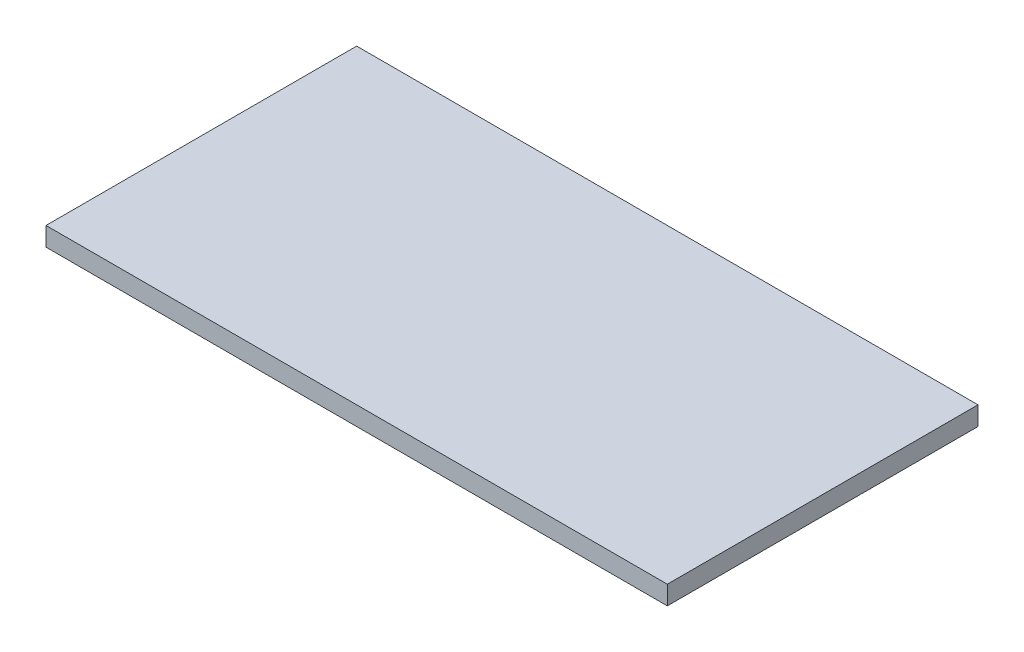
ISO-10303-21;
HEADER;
FILE_DESCRIPTION(('STEP AP214'),'2;1');
FILE_NAME('part.step','',(''),(''),'','','');
FILE_SCHEMA(('AUTOMOTIVE_DESIGN { 1 0 10303 214 1 1 1 1 }'));
ENDSEC;
DATA;
#1=APPLICATION_CONTEXT('core data for automotive mechanical design processes');
#2=APPLICATION_PROTOCOL_DEFINITION('international standard','automotive_design',2000,#1);
#3=PRODUCT_CONTEXT('',#1,'mechanical');
#4=PRODUCT('Part','Part','',(#3));
#5=PRODUCT_RELATED_PRODUCT_CATEGORY('part','',(#4));
#6=PRODUCT_DEFINITION_FORMATION('','',#4);
#7=PRODUCT_DEFINITION_CONTEXT('part definition',#1,'design');
#8=PRODUCT_DEFINITION('design','',#6,#7);
#9=PRODUCT_DEFINITION_SHAPE('','',#8);
#10=(LENGTH_UNIT() NAMED_UNIT(*) SI_UNIT(.MILLI.,.METRE.));
#11=(NAMED_UNIT(*) PLANE_ANGLE_UNIT() SI_UNIT($,.RADIAN.));
#12=(NAMED_UNIT(*) SI_UNIT($,.STERADIAN.) SOLID_ANGLE_UNIT());
#13=UNCERTAINTY_MEASURE_WITH_UNIT(LENGTH_MEASURE(1.E-05),#10,'distance_accuracy_value','');
#14=(GEOMETRIC_REPRESENTATION_CONTEXT(3) GLOBAL_UNCERTAINTY_ASSIGNED_CONTEXT((#13)) GLOBAL_UNIT_ASSIGNED_CONTEXT((#10,
#11,#12)) REPRESENTATION_CONTEXT('',''));
#15=CARTESIAN_POINT('',(0.,0.,0.));
#16=DIRECTION('',(0.,0.,1.));
#17=DIRECTION('',(1.,0.,0.));
#18=AXIS2_PLACEMENT_3D('',#15,#16,#17);
#19=CARTESIAN_POINT('',(10.,0.,0.));
#20=DIRECTION('',(-1.,0.,0.));
#21=DIRECTION('',(0.,0.,1.));
#22=AXIS2_PLACEMENT_3D('',#19,#20,#21);
#23=CYLINDRICAL_SURFACE('',#22,2.3);
#24=CARTESIAN_POINT('',(3.56144422615147,0.,0.));
#25=DIRECTION('',(-1.,0.,0.));
#26=DIRECTION('',(0.,0.,1.));
#27=AXIS2_PLACEMENT_3D('',#24,#25,#26);
#28=CIRCLE('',#27,2.3);
#29=CARTESIAN_POINT('',(3.56144422615147,0.,2.3));
#30=VERTEX_POINT('',#29);
#31=EDGE_CURVE('E228',#30,#30,#28,.T.);
#32=ORIENTED_EDGE('',*,*,#31,.T.);
#33=EDGE_LOOP('',(#32));
#34=FACE_BOUND('',#33,.T.);
#35=CARTESIAN_POINT('',(6.44,0.,0.));
#36=DIRECTION('',(1.,0.,0.));
#37=DIRECTION('',(0.,0.,-1.));
#38=AXIS2_PLACEMENT_3D('',#35,#36,#37);
#39=CIRCLE('',#38,2.3);
#40=CARTESIAN_POINT('',(6.44,0.,-2.3));
#41=VERTEX_POINT('',#40);
#42=EDGE_CURVE('E174',#41,#41,#39,.T.);
#43=ORIENTED_EDGE('',*,*,#42,.T.);
#44=EDGE_LOOP('',(#43));
#45=FACE_BOUND('',#44,.T.);
#46=ADVANCED_FACE('F33',(#34,#45),#23,.F.);
#47=CARTESIAN_POINT('',(0.,-4.,-5.));
#48=DIRECTION('',(-1.,0.,0.));
#49=DIRECTION('',(0.,0.,1.));
#50=AXIS2_PLACEMENT_3D('',#47,#48,#49);
#51=PLANE('',#50);
#52=DIRECTION('',(0.,1.,0.));
#53=VECTOR('',#52,1.);
#54=CARTESIAN_POINT('',(0.,-4.,-5.));
#55=LINE('',#54,#53);
#56=CARTESIAN_POINT('',(0.,-1.,-5.));
#57=VERTEX_POINT('',#56);
#58=CARTESIAN_POINT('',(0.,0.,-5.));
#59=VERTEX_POINT('',#58);
#60=EDGE_CURVE('E202',#57,#59,#55,.T.);
#61=ORIENTED_EDGE('',*,*,#60,.F.);
#62=CARTESIAN_POINT('',(0.,-1.,-2.));
#63=DIRECTION('',(-1.,0.,0.));
#64=DIRECTION('',(0.,0.,1.));
#65=AXIS2_PLACEMENT_3D('',#62,#63,#64);
#66=CIRCLE('',#65,3.);
#67=CARTESIAN_POINT('',(0.,-4.,-2.));
#68=VERTEX_POINT('',#67);
#69=EDGE_CURVE('E42',#57,#68,#66,.T.);
#70=ORIENTED_EDGE('',*,*,#69,.T.);
#71=DIRECTION('',(0.,0.,1.));
#72=VECTOR('',#71,1.);
#73=CARTESIAN_POINT('',(0.,-4.,-5.));
#74=LINE('',#73,#72);
#75=CARTESIAN_POINT('',(0.,-4.,2.));
#76=VERTEX_POINT('',#75);
#77=EDGE_CURVE('E197',#68,#76,#74,.T.);
#78=ORIENTED_EDGE('',*,*,#77,.T.);
#79=CARTESIAN_POINT('',(0.,-1.,2.));
#80=DIRECTION('',(-1.,0.,0.));
#81=DIRECTION('',(0.,0.,1.));
#82=AXIS2_PLACEMENT_3D('',#79,#80,#81);
#83=CIRCLE('',#82,3.);
#84=CARTESIAN_POINT('',(0.,-1.,5.));
#85=VERTEX_POINT('',#84);
#86=EDGE_CURVE('E50',#76,#85,#83,.T.);
#87=ORIENTED_EDGE('',*,*,#86,.T.);
#88=DIRECTION('',(0.,1.,0.));
#89=VECTOR('',#88,1.);
#90=CARTESIAN_POINT('',(0.,-4.,5.));
#91=LINE('',#90,#89);
#92=CARTESIAN_POINT('',(0.,0.,5.));
#93=VERTEX_POINT('',#92);
#94=EDGE_CURVE('E201',#85,#93,#91,.T.);
#95=ORIENTED_EDGE('',*,*,#94,.T.);
#96=CARTESIAN_POINT('',(0.,0.,8.));
#97=DIRECTION('',(-1.,0.,0.));
#98=DIRECTION('',(0.,0.,1.));
#99=AXIS2_PLACEMENT_3D('',#96,#97,#98);
#100=CIRCLE('',#99,3.);
#101=CARTESIAN_POINT('',(0.,3.,8.));
#102=VERTEX_POINT('',#101);
#103=EDGE_CURVE('E481',#93,#102,#100,.F.);
#104=ORIENTED_EDGE('',*,*,#103,.T.);
#105=DIRECTION('',(0.,0.,1.));
#106=VECTOR('',#105,1.);
#107=CARTESIAN_POINT('',(0.,3.,-16.5));
#108=LINE('',#107,#106);
#109=CARTESIAN_POINT('',(0.,3.,16.5));
#110=VERTEX_POINT('',#109);
#111=EDGE_CURVE('E172',#102,#110,#108,.T.);
#112=ORIENTED_EDGE('',*,*,#111,.T.);
#113=DIRECTION('',(0.,-1.,0.));
#114=VECTOR('',#113,1.);
#115=CARTESIAN_POINT('',(0.,5.,16.5));
#116=LINE('',#115,#114);
#117=CARTESIAN_POINT('',(0.,5.,16.5));
#118=VERTEX_POINT('',#117);
#119=EDGE_CURVE('E153',#118,#110,#116,.T.);
#120=ORIENTED_EDGE('',*,*,#119,.F.);
#121=DIRECTION('',(0.,0.,1.));
#122=VECTOR('',#121,1.);
#123=CARTESIAN_POINT('',(0.,5.,-16.5));
#124=LINE('',#123,#122);
#125=CARTESIAN_POINT('',(0.,5.,-16.5));
#126=VERTEX_POINT('',#125);
#127=EDGE_CURVE('E159',#126,#118,#124,.T.);
#128=ORIENTED_EDGE('',*,*,#127,.F.);
#129=DIRECTION('',(0.,-1.,0.));
#130=VECTOR('',#129,1.);
#131=CARTESIAN_POINT('',(0.,5.,-16.5));
#132=LINE('',#131,#130);
#133=CARTESIAN_POINT('',(0.,3.,-16.5));
#134=VERTEX_POINT('',#133);
#135=EDGE_CURVE('E535',#126,#134,#132,.T.);
#136=ORIENTED_EDGE('',*,*,#135,.T.);
#137=CARTESIAN_POINT('',(0.,3.,-8.));
#138=VERTEX_POINT('',#137);
#139=EDGE_CURVE('E524',#134,#138,#108,.T.);
#140=ORIENTED_EDGE('',*,*,#139,.T.);
#141=CARTESIAN_POINT('',(0.,0.,-8.));
#142=DIRECTION('',(-1.,0.,0.));
#143=DIRECTION('',(0.,0.,1.));
#144=AXIS2_PLACEMENT_3D('',#141,#142,#143);
#145=CIRCLE('',#144,3.);
#146=EDGE_CURVE('E485',#138,#59,#145,.F.);
#147=ORIENTED_EDGE('',*,*,#146,.T.);
#148=EDGE_LOOP('',(#61,#70,#78,#87,#95,#104,#112,#120,#128,#136,#140,#147));
#149=FACE_BOUND('',#148,.T.);
#150=CARTESIAN_POINT('',(0.,3.,-0.388104367406501));
#151=VERTEX_POINT('',#150);
#152=CARTESIAN_POINT('',(0.,3.,0.3881043674065));
#153=VERTEX_POINT('',#152);
#154=EDGE_CURVE('E523',#151,#153,#108,.T.);
#155=ORIENTED_EDGE('',*,*,#154,.T.);
#156=CARTESIAN_POINT('',(0.,0.,0.));
#157=DIRECTION('',(1.,0.,0.));
#158=DIRECTION('',(0.,0.,-1.));
#159=AXIS2_PLACEMENT_3D('',#156,#157,#158);
#160=CIRCLE('',#159,3.025);
#161=EDGE_CURVE('E193',#153,#151,#160,.T.);
#162=ORIENTED_EDGE('',*,*,#161,.T.);
#163=EDGE_LOOP('',(#155,#162));
#164=FACE_BOUND('',#163,.T.);
#165=ADVANCED_FACE('F169',(#149,#164),#51,.T.);
#166=CARTESIAN_POINT('',(0.,-4.,-5.));
#167=DIRECTION('',(0.,0.,-1.));
#168=DIRECTION('',(-1.,0.,0.));
#169=AXIS2_PLACEMENT_3D('',#166,#167,#168);
#170=PLANE('',#169);
#171=DIRECTION('',(0.,1.,0.));
#172=VECTOR('',#171,1.);
#173=CARTESIAN_POINT('',(15.,-4.,-5.));
#174=LINE('',#173,#172);
#175=CARTESIAN_POINT('',(15.,-1.,-5.));
#176=VERTEX_POINT('',#175);
#177=CARTESIAN_POINT('',(15.,0.,-5.));
#178=VERTEX_POINT('',#177);
#179=EDGE_CURVE('E205',#176,#178,#174,.T.);
#180=ORIENTED_EDGE('',*,*,#179,.F.);
#181=DIRECTION('',(-1.,0.,0.));
#182=VECTOR('',#181,1.);
#183=CARTESIAN_POINT('',(0.,-1.,-5.));
#184=LINE('',#183,#182);
#185=EDGE_CURVE('E58',#176,#57,#184,.T.);
#186=ORIENTED_EDGE('',*,*,#185,.T.);
#187=ORIENTED_EDGE('',*,*,#60,.T.);
#188=DIRECTION('',(-1.,0.,0.));
#189=VECTOR('',#188,1.);
#190=CARTESIAN_POINT('',(0.,0.,-5.));
#191=LINE('',#190,#189);
#192=EDGE_CURVE('E469',#59,#178,#191,.F.);
#193=ORIENTED_EDGE('',*,*,#192,.T.);
#194=EDGE_LOOP('',(#180,#186,#187,#193));
#195=FACE_BOUND('',#194,.T.);
#196=ADVANCED_FACE('F271',(#195),#170,.T.);
#197=CARTESIAN_POINT('',(15.,-4.,-5.));
#198=DIRECTION('',(1.,0.,0.));
#199=DIRECTION('',(0.,0.,-1.));
#200=AXIS2_PLACEMENT_3D('',#197,#198,#199);
#201=PLANE('',#200);
#202=DIRECTION('',(0.,1.,0.));
#203=VECTOR('',#202,1.);
#204=CARTESIAN_POINT('',(15.,-4.,4.99999999999999));
#205=LINE('',#204,#203);
#206=CARTESIAN_POINT('',(15.,-1.,4.99999999999999));
#207=VERTEX_POINT('',#206);
#208=CARTESIAN_POINT('',(15.,0.,4.99999999999999));
#209=VERTEX_POINT('',#208);
#210=EDGE_CURVE('E207',#207,#209,#205,.T.);
#211=ORIENTED_EDGE('',*,*,#210,.F.);
#212=DIRECTION('',(0.,0.,-1.));
#213=VECTOR('',#212,1.);
#214=CARTESIAN_POINT('',(15.,-1.,-5.));
#215=LINE('',#214,#213);
#216=EDGE_CURVE('E477',#207,#176,#215,.T.);
#217=ORIENTED_EDGE('',*,*,#216,.T.);
#218=ORIENTED_EDGE('',*,*,#179,.T.);
#219=DIRECTION('',(0.,0.,-1.));
#220=VECTOR('',#219,1.);
#221=CARTESIAN_POINT('',(15.,0.,-5.));
#222=LINE('',#221,#220);
#223=EDGE_CURVE('E474',#178,#209,#222,.F.);
#224=ORIENTED_EDGE('',*,*,#223,.T.);
#225=EDGE_LOOP('',(#211,#217,#218,#224));
#226=FACE_BOUND('',#225,.T.);
#227=ADVANCED_FACE('F380',(#226),#201,.T.);
#228=CARTESIAN_POINT('',(0.,-4.,5.));
#229=DIRECTION('',(0.,0.,1.));
#230=DIRECTION('',(1.,0.,0.));
#231=AXIS2_PLACEMENT_3D('',#228,#229,#230);
#232=PLANE('',#231);
#233=ORIENTED_EDGE('',*,*,#94,.F.);
#234=DIRECTION('',(1.,0.,0.));
#235=VECTOR('',#234,1.);
#236=CARTESIAN_POINT('',(15.,-1.,4.99999999999999));
#237=LINE('',#236,#235);
#238=EDGE_CURVE('E11',#85,#207,#237,.T.);
#239=ORIENTED_EDGE('',*,*,#238,.T.);
#240=ORIENTED_EDGE('',*,*,#210,.T.);
#241=DIRECTION('',(1.,0.,0.));
#242=VECTOR('',#241,1.);
#243=CARTESIAN_POINT('',(0.,0.,5.));
#244=LINE('',#243,#242);
#245=EDGE_CURVE('E508',#209,#93,#244,.F.);
#246=ORIENTED_EDGE('',*,*,#245,.T.);
#247=EDGE_LOOP('',(#233,#239,#240,#246));
#248=FACE_BOUND('',#247,.T.);
#249=ADVANCED_FACE('F370',(#248),#232,.T.);
#250=CARTESIAN_POINT('',(0.,-4.,0.));
#251=DIRECTION('',(0.,1.,0.));
#252=DIRECTION('',(0.,0.,1.));
#253=AXIS2_PLACEMENT_3D('',#250,#251,#252);
#254=PLANE('',#253);
#255=ORIENTED_EDGE('',*,*,#77,.F.);
#256=DIRECTION('',(-1.,0.,0.));
#257=VECTOR('',#256,1.);
#258=CARTESIAN_POINT('',(15.,-4.,-2.));
#259=LINE('',#258,#257);
#260=CARTESIAN_POINT('',(12.,-4.,-2.));
#261=VERTEX_POINT('',#260);
#262=EDGE_CURVE('E492',#68,#261,#259,.F.);
#263=ORIENTED_EDGE('',*,*,#262,.T.);
#264=DIRECTION('',(0.,0.,-1.));
#265=VECTOR('',#264,1.);
#266=CARTESIAN_POINT('',(12.,-4.,4.99999999999999));
#267=LINE('',#266,#265);
#268=CARTESIAN_POINT('',(12.,-4.,1.99999999999999));
#269=VERTEX_POINT('',#268);
#270=EDGE_CURVE('E483',#261,#269,#267,.F.);
#271=ORIENTED_EDGE('',*,*,#270,.T.);
#272=DIRECTION('',(1.,0.,0.));
#273=VECTOR('',#272,1.);
#274=CARTESIAN_POINT('',(0.,-4.,2.));
#275=LINE('',#274,#273);
#276=EDGE_CURVE('E480',#269,#76,#275,.F.);
#277=ORIENTED_EDGE('',*,*,#276,.T.);
#278=EDGE_LOOP('',(#255,#263,#271,#277));
#279=FACE_BOUND('',#278,.T.);
#280=ADVANCED_FACE('F283',(#279),#254,.F.);
#281=CARTESIAN_POINT('',(2.6,0.,0.));
#282=DIRECTION('',(-1.,0.,0.));
#283=DIRECTION('',(0.,0.,1.));
#284=AXIS2_PLACEMENT_3D('',#281,#282,#283);
#285=CYLINDRICAL_SURFACE('',#284,3.025);
#286=ORIENTED_EDGE('',*,*,#161,.F.);
#287=DIRECTION('',(-1.,0.,0.));
#288=VECTOR('',#287,1.);
#289=CARTESIAN_POINT('',(2.6,3.,0.388104367406501));
#290=LINE('',#289,#288);
#291=CARTESIAN_POINT('',(2.5999999999998,3.,0.388104367406495));
#292=VERTEX_POINT('',#291);
#293=EDGE_CURVE('E204',#292,#153,#290,.T.);
#294=ORIENTED_EDGE('',*,*,#293,.F.);
#295=CARTESIAN_POINT('',(2.6,0.,0.));
#296=DIRECTION('',(1.,0.,0.));
#297=DIRECTION('',(0.,0.,-1.));
#298=AXIS2_PLACEMENT_3D('',#295,#296,#297);
#299=CIRCLE('',#298,3.025);
#300=CARTESIAN_POINT('',(2.6,3.,-0.388104367406501));
#301=VERTEX_POINT('',#300);
#302=EDGE_CURVE('E194',#292,#301,#299,.T.);
#303=ORIENTED_EDGE('',*,*,#302,.T.);
#304=DIRECTION('',(-1.,0.,0.));
#305=VECTOR('',#304,1.);
#306=CARTESIAN_POINT('',(2.6,3.,-0.388104367406501));
#307=LINE('',#306,#305);
#308=EDGE_CURVE('E212',#151,#301,#307,.F.);
#309=ORIENTED_EDGE('',*,*,#308,.F.);
#310=EDGE_LOOP('',(#286,#294,#303,#309));
#311=FACE_BOUND('',#310,.T.);
#312=ADVANCED_FACE('F279',(#311),#285,.F.);
#313=CARTESIAN_POINT('',(18.5559920523572,0.,0.));
#314=DIRECTION('',(-1.,0.,0.));
#315=DIRECTION('',(0.,0.,1.));
#316=AXIS2_PLACEMENT_3D('',#313,#314,#315);
#317=CYLINDRICAL_SURFACE('',#316,3.025);
#318=CARTESIAN_POINT('',(6.44,0.,0.));
#319=DIRECTION('',(1.,0.,0.));
#320=DIRECTION('',(0.,0.,-1.));
#321=AXIS2_PLACEMENT_3D('',#318,#319,#320);
#322=CIRCLE('',#321,3.025);
#323=CARTESIAN_POINT('',(6.44,3.,0.3881043674065));
#324=VERTEX_POINT('',#323);
#325=CARTESIAN_POINT('',(6.44,3.,-0.3881043674065));
#326=VERTEX_POINT('',#325);
#327=EDGE_CURVE('E177',#324,#326,#322,.T.);
#328=ORIENTED_EDGE('',*,*,#327,.F.);
#329=DIRECTION('',(-1.,0.,0.));
#330=VECTOR('',#329,1.);
#331=CARTESIAN_POINT('',(18.5559920523572,3.,0.3881043674065));
#332=LINE('',#331,#330);
#333=CARTESIAN_POINT('',(10.,3.,0.388104367406501));
#334=VERTEX_POINT('',#333);
#335=EDGE_CURVE('E215',#334,#324,#332,.T.);
#336=ORIENTED_EDGE('',*,*,#335,.F.);
#337=CARTESIAN_POINT('',(10.,0.,0.));
#338=DIRECTION('',(1.,0.,0.));
#339=DIRECTION('',(0.,0.,-1.));
#340=AXIS2_PLACEMENT_3D('',#337,#338,#339);
#341=CIRCLE('',#340,3.025);
#342=CARTESIAN_POINT('',(10.,3.,-0.388104367406501));
#343=VERTEX_POINT('',#342);
#344=EDGE_CURVE('E183',#334,#343,#341,.T.);
#345=ORIENTED_EDGE('',*,*,#344,.T.);
#346=DIRECTION('',(-1.,0.,0.));
#347=VECTOR('',#346,1.);
#348=CARTESIAN_POINT('',(18.5559920523572,3.,-0.3881043674065));
#349=LINE('',#348,#347);
#350=EDGE_CURVE('E217',#326,#343,#349,.F.);
#351=ORIENTED_EDGE('',*,*,#350,.F.);
#352=EDGE_LOOP('',(#328,#336,#345,#351));
#353=FACE_BOUND('',#352,.T.);
#354=ADVANCED_FACE('F282',(#353),#317,.F.);
#355=CARTESIAN_POINT('',(6.44,0.,0.));
#356=DIRECTION('',(1.,0.,0.));
#357=DIRECTION('',(0.,0.,-1.));
#358=AXIS2_PLACEMENT_3D('',#355,#356,#357);
#359=PLANE('',#358);
#360=ORIENTED_EDGE('',*,*,#327,.T.);
#361=DIRECTION('',(0.,0.,-1.));
#362=VECTOR('',#361,1.);
#363=CARTESIAN_POINT('',(6.44,3.,0.));
#364=LINE('',#363,#362);
#365=EDGE_CURVE('E191',#324,#326,#364,.T.);
#366=ORIENTED_EDGE('',*,*,#365,.F.);
#367=EDGE_LOOP('',(#360,#366));
#368=FACE_BOUND('',#367,.T.);
#369=ORIENTED_EDGE('',*,*,#42,.F.);
#370=EDGE_LOOP('',(#369));
#371=FACE_BOUND('',#370,.T.);
#372=ADVANCED_FACE('F277',(#368,#371),#359,.T.);
#373=CARTESIAN_POINT('',(10.,0.,0.));
#374=DIRECTION('',(1.,0.,0.));
#375=DIRECTION('',(0.,0.,-1.));
#376=AXIS2_PLACEMENT_3D('',#373,#374,#375);
#377=PLANE('',#376);
#378=DIRECTION('',(0.,0.,-1.));
#379=VECTOR('',#378,1.);
#380=CARTESIAN_POINT('',(10.,3.,0.));
#381=LINE('',#380,#379);
#382=EDGE_CURVE('E185',#334,#343,#381,.T.);
#383=ORIENTED_EDGE('',*,*,#382,.T.);
#384=ORIENTED_EDGE('',*,*,#344,.F.);
#385=EDGE_LOOP('',(#383,#384));
#386=FACE_BOUND('',#385,.T.);
#387=ADVANCED_FACE('F239',(#386),#377,.F.);
#388=CARTESIAN_POINT('',(3.56144422615147,0.,0.));
#389=DIRECTION('',(-1.,0.,0.));
#390=DIRECTION('',(0.,0.,1.));
#391=AXIS2_PLACEMENT_3D('',#388,#389,#390);
#392=TOROIDAL_SURFACE('',#391,3.3,1.);
#393=ORIENTED_EDGE('',*,*,#31,.F.);
#394=EDGE_LOOP('',(#393));
#395=FACE_BOUND('',#394,.T.);
#396=CARTESIAN_POINT('',(2.6,3.,-0.388104367406501));
#397=CARTESIAN_POINT('',(2.60153533883469,3.,-0.346369526190029));
#398=CARTESIAN_POINT('',(2.60286824638819,3.,-0.304626913681339));
#399=CARTESIAN_POINT('',(2.60506317141405,3.,-0.221128548311242));
#400=CARTESIAN_POINT('',(2.60592517889879,3.,-0.179372795189921));
#401=CARTESIAN_POINT('',(2.60770509071682,3.,-0.0541362812968553));
#402=CARTESIAN_POINT('',(2.60781864889523,3.,0.0293579118246574));
#403=CARTESIAN_POINT('',(2.60586232864534,3.,0.196318445080578));
#404=CARTESIAN_POINT('',(2.60379243513685,3.,0.279784785018633));
#405=CARTESIAN_POINT('',(2.59798650654551,3.,0.446670897482142));
#406=CARTESIAN_POINT('',(2.59425014122542,3.,0.530090657494836));
#407=CARTESIAN_POINT('',(2.58606920095457,3.,0.696822448172077));
#408=CARTESIAN_POINT('',(2.58162522422337,3.,0.780134510437045));
#409=CARTESIAN_POINT('',(2.57327887846192,3.,0.946784556642461));
#410=CARTESIAN_POINT('',(2.56937649969051,3.,1.03012254008967));
#411=CARTESIAN_POINT('',(2.56353926046712,3.,1.19692079950574));
#412=CARTESIAN_POINT('',(2.56160515899396,3.,1.28038111023116));
#413=CARTESIAN_POINT('',(2.56130373075992,3.,1.4473932865254));
#414=CARTESIAN_POINT('',(2.56294053133916,3.,1.53094514635617));
#415=CARTESIAN_POINT('',(2.56716610070982,3.,1.61444676558167));
#416=B_SPLINE_CURVE_WITH_KNOTS('',3,(#396,#397,#398,#399,#400,#401,#402,#403,#404,#405,#406,
#407,#408,#409,#410,#411,#412,#413,#414,#415),.UNSPECIFIED.,.F.,.F.,(4,2,2,2,2,2,2,2,2,4),(0.,
0.125288971345742,0.250580599919346,0.501031255120066,0.751483640092038,1.00198567815763,
1.25227705361597,1.50256392676218,1.75294727540829,2.00362017685477),.UNSPECIFIED.);
#417=EDGE_CURVE('E219',#301,#292,#416,.T.);
#418=ORIENTED_EDGE('',*,*,#417,.F.);
#419=ORIENTED_EDGE('',*,*,#302,.F.);
#420=EDGE_LOOP('',(#418,#419));
#421=FACE_BOUND('',#420,.T.);
#422=ADVANCED_FACE('F233',(#395,#421),#392,.T.);
#423=CARTESIAN_POINT('',(0.,3.,0.));
#424=DIRECTION('',(0.,1.,0.));
#425=DIRECTION('',(0.,0.,1.));
#426=AXIS2_PLACEMENT_3D('',#423,#424,#425);
#427=PLANE('',#426);
#428=ORIENTED_EDGE('',*,*,#308,.T.);
#429=ORIENTED_EDGE('',*,*,#417,.T.);
#430=ORIENTED_EDGE('',*,*,#293,.T.);
#431=ORIENTED_EDGE('',*,*,#154,.F.);
#432=EDGE_LOOP('',(#428,#429,#430,#431));
#433=FACE_BOUND('',#432,.T.);
#434=ADVANCED_FACE('F238',(#433),#427,.F.);
#435=CARTESIAN_POINT('',(0.,5.,0.));
#436=DIRECTION('',(0.,1.,0.));
#437=DIRECTION('',(0.,0.,1.));
#438=AXIS2_PLACEMENT_3D('',#435,#436,#437);
#439=PLANE('',#438);
#440=ORIENTED_EDGE('',*,*,#127,.T.);
#441=DIRECTION('',(1.,0.,0.));
#442=VECTOR('',#441,1.);
#443=CARTESIAN_POINT('',(0.,5.,16.5));
#444=LINE('',#443,#442);
#445=CARTESIAN_POINT('',(66.,5.,16.5));
#446=VERTEX_POINT('',#445);
#447=EDGE_CURVE('E149',#118,#446,#444,.T.);
#448=ORIENTED_EDGE('',*,*,#447,.T.);
#449=DIRECTION('',(0.,0.,-1.));
#450=VECTOR('',#449,1.);
#451=CARTESIAN_POINT('',(66.,5.,-16.5));
#452=LINE('',#451,#450);
#453=CARTESIAN_POINT('',(66.,5.,-16.5));
#454=VERTEX_POINT('',#453);
#455=EDGE_CURVE('E158',#446,#454,#452,.T.);
#456=ORIENTED_EDGE('',*,*,#455,.T.);
#457=DIRECTION('',(-1.,0.,0.));
#458=VECTOR('',#457,1.);
#459=CARTESIAN_POINT('',(0.,5.,-16.5));
#460=LINE('',#459,#458);
#461=EDGE_CURVE('E164',#454,#126,#460,.T.);
#462=ORIENTED_EDGE('',*,*,#461,.T.);
#463=EDGE_LOOP('',(#440,#448,#456,#462));
#464=FACE_BOUND('',#463,.T.);
#465=ADVANCED_FACE('F162',(#464),#439,.T.);
#466=CARTESIAN_POINT('',(0.,5.,-16.5));
#467=DIRECTION('',(0.,0.,1.));
#468=DIRECTION('',(1.,0.,0.));
#469=AXIS2_PLACEMENT_3D('',#466,#467,#468);
#470=PLANE('',#469);
#471=DIRECTION('',(-1.,0.,0.));
#472=VECTOR('',#471,1.);
#473=CARTESIAN_POINT('',(0.,3.,-16.5));
#474=LINE('',#473,#472);
#475=CARTESIAN_POINT('',(66.,3.,-16.5));
#476=VERTEX_POINT('',#475);
#477=EDGE_CURVE('E167',#476,#134,#474,.T.);
#478=ORIENTED_EDGE('',*,*,#477,.T.);
#479=ORIENTED_EDGE('',*,*,#135,.F.);
#480=ORIENTED_EDGE('',*,*,#461,.F.);
#481=DIRECTION('',(0.,-1.,0.));
#482=VECTOR('',#481,1.);
#483=CARTESIAN_POINT('',(66.,5.,-16.5));
#484=LINE('',#483,#482);
#485=EDGE_CURVE('E179',#454,#476,#484,.T.);
#486=ORIENTED_EDGE('',*,*,#485,.T.);
#487=EDGE_LOOP('',(#478,#479,#480,#486));
#488=FACE_BOUND('',#487,.T.);
#489=ADVANCED_FACE('F297',(#488),#470,.F.);
#490=CARTESIAN_POINT('',(66.,5.,-16.5));
#491=DIRECTION('',(-1.,0.,0.));
#492=DIRECTION('',(0.,0.,1.));
#493=AXIS2_PLACEMENT_3D('',#490,#491,#492);
#494=PLANE('',#493);
#495=DIRECTION('',(0.,0.,-1.));
#496=VECTOR('',#495,1.);
#497=CARTESIAN_POINT('',(66.,3.,-16.5));
#498=LINE('',#497,#496);
#499=CARTESIAN_POINT('',(66.,3.,16.5));
#500=VERTEX_POINT('',#499);
#501=EDGE_CURVE('E532',#500,#476,#498,.T.);
#502=ORIENTED_EDGE('',*,*,#501,.T.);
#503=ORIENTED_EDGE('',*,*,#485,.F.);
#504=ORIENTED_EDGE('',*,*,#455,.F.);
#505=DIRECTION('',(0.,-1.,0.));
#506=VECTOR('',#505,1.);
#507=CARTESIAN_POINT('',(66.,5.,16.5));
#508=LINE('',#507,#506);
#509=EDGE_CURVE('E155',#446,#500,#508,.T.);
#510=ORIENTED_EDGE('',*,*,#509,.T.);
#511=EDGE_LOOP('',(#502,#503,#504,#510));
#512=FACE_BOUND('',#511,.T.);
#513=ADVANCED_FACE('F294',(#512),#494,.F.);
#514=CARTESIAN_POINT('',(0.,5.,16.5));
#515=DIRECTION('',(0.,0.,-1.));
#516=DIRECTION('',(-1.,0.,0.));
#517=AXIS2_PLACEMENT_3D('',#514,#515,#516);
#518=PLANE('',#517);
#519=DIRECTION('',(1.,0.,0.));
#520=VECTOR('',#519,1.);
#521=CARTESIAN_POINT('',(0.,3.,16.5));
#522=LINE('',#521,#520);
#523=EDGE_CURVE('E527',#110,#500,#522,.T.);
#524=ORIENTED_EDGE('',*,*,#523,.T.);
#525=ORIENTED_EDGE('',*,*,#509,.F.);
#526=ORIENTED_EDGE('',*,*,#447,.F.);
#527=ORIENTED_EDGE('',*,*,#119,.T.);
#528=EDGE_LOOP('',(#524,#525,#526,#527));
#529=FACE_BOUND('',#528,.T.);
#530=ADVANCED_FACE('F151',(#529),#518,.F.);
#531=DIRECTION('',(0.,0.,-1.));
#532=VECTOR('',#531,1.);
#533=CARTESIAN_POINT('',(18.,3.,0.));
#534=LINE('',#533,#532);
#535=CARTESIAN_POINT('',(18.,3.,7.99999999999999));
#536=VERTEX_POINT('',#535);
#537=CARTESIAN_POINT('',(18.,3.,-8.));
#538=VERTEX_POINT('',#537);
#539=EDGE_CURVE('E516',#536,#538,#534,.T.);
#540=ORIENTED_EDGE('',*,*,#539,.T.);
#541=DIRECTION('',(-1.,0.,0.));
#542=VECTOR('',#541,1.);
#543=CARTESIAN_POINT('',(0.,3.,-8.));
#544=LINE('',#543,#542);
#545=EDGE_CURVE('E512',#538,#138,#544,.T.);
#546=ORIENTED_EDGE('',*,*,#545,.T.);
#547=ORIENTED_EDGE('',*,*,#139,.F.);
#548=ORIENTED_EDGE('',*,*,#477,.F.);
#549=ORIENTED_EDGE('',*,*,#501,.F.);
#550=ORIENTED_EDGE('',*,*,#523,.F.);
#551=ORIENTED_EDGE('',*,*,#111,.F.);
#552=DIRECTION('',(1.,0.,0.));
#553=VECTOR('',#552,1.);
#554=CARTESIAN_POINT('',(0.,3.,8.));
#555=LINE('',#554,#553);
#556=EDGE_CURVE('E515',#102,#536,#555,.T.);
#557=ORIENTED_EDGE('',*,*,#556,.T.);
#558=EDGE_LOOP('',(#540,#546,#547,#548,#549,#550,#551,#557));
#559=FACE_BOUND('',#558,.T.);
#560=ADVANCED_FACE('F293',(#559),#427,.F.);
#561=ORIENTED_EDGE('',*,*,#365,.T.);
#562=ORIENTED_EDGE('',*,*,#350,.T.);
#563=ORIENTED_EDGE('',*,*,#382,.F.);
#564=ORIENTED_EDGE('',*,*,#335,.T.);
#565=EDGE_LOOP('',(#561,#562,#563,#564));
#566=FACE_BOUND('',#565,.T.);
#567=ADVANCED_FACE('F253',(#566),#427,.F.);
#568=CARTESIAN_POINT('',(0.,0.,8.));
#569=DIRECTION('',(1.,0.,0.));
#570=DIRECTION('',(0.,0.,-1.));
#571=AXIS2_PLACEMENT_3D('',#568,#569,#570);
#572=CYLINDRICAL_SURFACE('',#571,3.);
#573=ORIENTED_EDGE('',*,*,#103,.F.);
#574=ORIENTED_EDGE('',*,*,#245,.F.);
#575=CARTESIAN_POINT('',(18.,0.,7.99999999999999));
#576=DIRECTION('',(0.707106781186547,0.,-0.707106781186548));
#577=DIRECTION('',(-0.707106781186548,0.,-0.707106781186547));
#578=AXIS2_PLACEMENT_3D('',#575,#576,#577);
#579=ELLIPSE('',#578,4.24264068711928,3.);
#580=EDGE_CURVE('E488',#536,#209,#579,.F.);
#581=ORIENTED_EDGE('',*,*,#580,.F.);
#582=ORIENTED_EDGE('',*,*,#556,.F.);
#583=EDGE_LOOP('',(#573,#574,#581,#582));
#584=FACE_BOUND('',#583,.T.);
#585=ADVANCED_FACE('F249',(#584),#572,.F.);
#586=CARTESIAN_POINT('',(18.,0.,0.));
#587=DIRECTION('',(0.,0.,-1.));
#588=DIRECTION('',(-1.,0.,0.));
#589=AXIS2_PLACEMENT_3D('',#586,#587,#588);
#590=CYLINDRICAL_SURFACE('',#589,3.);
#591=ORIENTED_EDGE('',*,*,#580,.T.);
#592=ORIENTED_EDGE('',*,*,#223,.F.);
#593=CARTESIAN_POINT('',(18.,0.,-8.));
#594=DIRECTION('',(-0.707106781186548,0.,-0.707106781186547));
#595=DIRECTION('',(0.707106781186547,0.,-0.707106781186548));
#596=AXIS2_PLACEMENT_3D('',#593,#594,#595);
#597=ELLIPSE('',#596,4.24264068711928,3.);
#598=EDGE_CURVE('E499',#538,#178,#597,.F.);
#599=ORIENTED_EDGE('',*,*,#598,.F.);
#600=ORIENTED_EDGE('',*,*,#539,.F.);
#601=EDGE_LOOP('',(#591,#592,#599,#600));
#602=FACE_BOUND('',#601,.T.);
#603=ADVANCED_FACE('F245',(#602),#590,.F.);
#604=CARTESIAN_POINT('',(0.,0.,-8.));
#605=DIRECTION('',(-1.,0.,0.));
#606=DIRECTION('',(0.,0.,1.));
#607=AXIS2_PLACEMENT_3D('',#604,#605,#606);
#608=CYLINDRICAL_SURFACE('',#607,3.);
#609=ORIENTED_EDGE('',*,*,#598,.T.);
#610=ORIENTED_EDGE('',*,*,#192,.F.);
#611=ORIENTED_EDGE('',*,*,#146,.F.);
#612=ORIENTED_EDGE('',*,*,#545,.F.);
#613=EDGE_LOOP('',(#609,#610,#611,#612));
#614=FACE_BOUND('',#613,.T.);
#615=ADVANCED_FACE('F242',(#614),#608,.F.);
#616=CARTESIAN_POINT('',(0.,-1.,2.));
#617=DIRECTION('',(-1.,0.,0.));
#618=DIRECTION('',(0.,0.,1.));
#619=AXIS2_PLACEMENT_3D('',#616,#617,#618);
#620=CYLINDRICAL_SURFACE('',#619,3.);
#621=ORIENTED_EDGE('',*,*,#86,.F.);
#622=ORIENTED_EDGE('',*,*,#276,.F.);
#623=CARTESIAN_POINT('',(12.,-1.,1.99999999999999));
#624=DIRECTION('',(-0.707106781186547,0.,0.707106781186548));
#625=DIRECTION('',(-0.707106781186548,0.,-0.707106781186547));
#626=AXIS2_PLACEMENT_3D('',#623,#624,#625);
#627=ELLIPSE('',#626,4.24264068711928,3.);
#628=EDGE_CURVE('E37',#207,#269,#627,.F.);
#629=ORIENTED_EDGE('',*,*,#628,.F.);
#630=ORIENTED_EDGE('',*,*,#238,.F.);
#631=EDGE_LOOP('',(#621,#622,#629,#630));
#632=FACE_BOUND('',#631,.T.);
#633=ADVANCED_FACE('F35',(#632),#620,.T.);
#634=CARTESIAN_POINT('',(0.,-1.,-2.));
#635=DIRECTION('',(1.,0.,0.));
#636=DIRECTION('',(0.,0.,-1.));
#637=AXIS2_PLACEMENT_3D('',#634,#635,#636);
#638=CYLINDRICAL_SURFACE('',#637,3.);
#639=ORIENTED_EDGE('',*,*,#69,.F.);
#640=ORIENTED_EDGE('',*,*,#185,.F.);
#641=CARTESIAN_POINT('',(12.,-1.,-2.));
#642=DIRECTION('',(0.707106781186548,0.,0.707106781186547));
#643=DIRECTION('',(0.707106781186547,0.,-0.707106781186548));
#644=AXIS2_PLACEMENT_3D('',#641,#642,#643);
#645=ELLIPSE('',#644,4.24264068711928,3.);
#646=EDGE_CURVE('E496',#261,#176,#645,.T.);
#647=ORIENTED_EDGE('',*,*,#646,.F.);
#648=ORIENTED_EDGE('',*,*,#262,.F.);
#649=EDGE_LOOP('',(#639,#640,#647,#648));
#650=FACE_BOUND('',#649,.T.);
#651=ADVANCED_FACE('F257',(#650),#638,.T.);
#652=CARTESIAN_POINT('',(12.,-1.,-5.));
#653=DIRECTION('',(0.,0.,1.));
#654=DIRECTION('',(1.,0.,0.));
#655=AXIS2_PLACEMENT_3D('',#652,#653,#654);
#656=CYLINDRICAL_SURFACE('',#655,3.);
#657=ORIENTED_EDGE('',*,*,#628,.T.);
#658=ORIENTED_EDGE('',*,*,#270,.F.);
#659=ORIENTED_EDGE('',*,*,#646,.T.);
#660=ORIENTED_EDGE('',*,*,#216,.F.);
#661=EDGE_LOOP('',(#657,#658,#659,#660));
#662=FACE_BOUND('',#661,.T.);
#663=ADVANCED_FACE('F255',(#662),#656,.T.);
#664=CLOSED_SHELL('',(#46,#165,#196,#227,#249,#280,#312,#354,#372,#387,#422,#434,#465,#489,#513,
#530,#560,#567,#585,#603,#615,#633,#651,#663));
#665=MANIFOLD_SOLID_BREP('B2',#664);
#666=ADVANCED_BREP_SHAPE_REPRESENTATION('',(#18,#665),#14);
#667=SHAPE_DEFINITION_REPRESENTATION(#9,#666);
ENDSEC;
END-ISO-10303-21;
